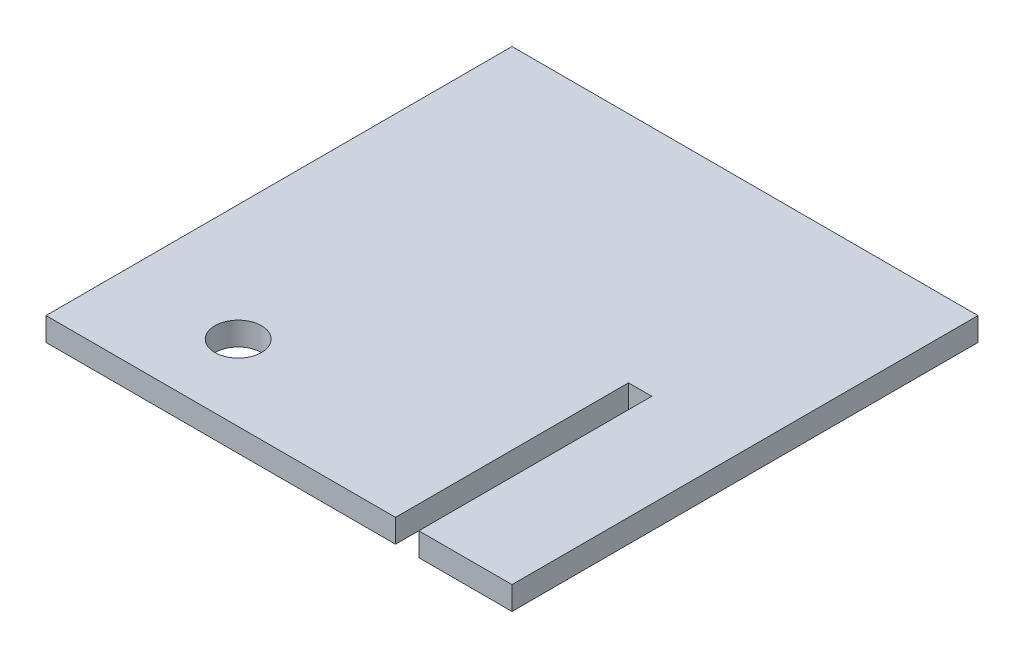
ISO-10303-21;
HEADER;
FILE_DESCRIPTION(('STEP AP214'),'2;1');
FILE_NAME('part.step','',(''),(''),'','','');
FILE_SCHEMA(('AUTOMOTIVE_DESIGN { 1 0 10303 214 1 1 1 1 }'));
ENDSEC;
DATA;
#1=APPLICATION_CONTEXT('core data for automotive mechanical design processes');
#2=APPLICATION_PROTOCOL_DEFINITION('international standard','automotive_design',2000,#1);
#3=PRODUCT_CONTEXT('',#1,'mechanical');
#4=PRODUCT('Part','Part','',(#3));
#5=PRODUCT_RELATED_PRODUCT_CATEGORY('part','',(#4));
#6=PRODUCT_DEFINITION_FORMATION('','',#4);
#7=PRODUCT_DEFINITION_CONTEXT('part definition',#1,'design');
#8=PRODUCT_DEFINITION('design','',#6,#7);
#9=PRODUCT_DEFINITION_SHAPE('','',#8);
#10=(LENGTH_UNIT() NAMED_UNIT(*) SI_UNIT(.MILLI.,.METRE.));
#11=(NAMED_UNIT(*) PLANE_ANGLE_UNIT() SI_UNIT($,.RADIAN.));
#12=(NAMED_UNIT(*) SI_UNIT($,.STERADIAN.) SOLID_ANGLE_UNIT());
#13=UNCERTAINTY_MEASURE_WITH_UNIT(LENGTH_MEASURE(1.E-05),#10,'distance_accuracy_value','');
#14=(GEOMETRIC_REPRESENTATION_CONTEXT(3) GLOBAL_UNCERTAINTY_ASSIGNED_CONTEXT((#13)) GLOBAL_UNIT_ASSIGNED_CONTEXT((#10,
#11,#12)) REPRESENTATION_CONTEXT('',''));
#15=CARTESIAN_POINT('',(0.,0.,0.));
#16=DIRECTION('',(0.,0.,1.));
#17=DIRECTION('',(1.,0.,0.));
#18=AXIS2_PLACEMENT_3D('',#15,#16,#17);
#19=CARTESIAN_POINT('',(-127.,6.35,0.));
#20=DIRECTION('',(0.,0.,-1.));
#21=DIRECTION('',(-1.,0.,0.));
#22=AXIS2_PLACEMENT_3D('',#19,#20,#21);
#23=PLANE('',#22);
#24=DIRECTION('',(1.,0.,0.));
#25=VECTOR('',#24,1.);
#26=CARTESIAN_POINT('',(-127.,6.35,0.));
#27=LINE('',#26,#25);
#28=CARTESIAN_POINT('',(76.2000000000002,6.35000000000002,0.));
#29=VERTEX_POINT('',#28);
#30=CARTESIAN_POINT('',(127.,6.35,0.));
#31=VERTEX_POINT('',#30);
#32=EDGE_CURVE('E139',#29,#31,#27,.T.);
#33=ORIENTED_EDGE('',*,*,#32,.F.);
#34=DIRECTION('',(0.,1.,0.));
#35=VECTOR('',#34,1.);
#36=CARTESIAN_POINT('',(76.2000000000002,-6.35000000000002,0.));
#37=LINE('',#36,#35);
#38=CARTESIAN_POINT('',(76.2000000000002,-6.35000000000002,0.));
#39=VERTEX_POINT('',#38);
#40=EDGE_CURVE('E128',#39,#29,#37,.T.);
#41=ORIENTED_EDGE('',*,*,#40,.F.);
#42=DIRECTION('',(1.,0.,0.));
#43=VECTOR('',#42,1.);
#44=CARTESIAN_POINT('',(-127.,-6.35,0.));
#45=LINE('',#44,#43);
#46=CARTESIAN_POINT('',(127.,-6.35,0.));
#47=VERTEX_POINT('',#46);
#48=EDGE_CURVE('E89',#39,#47,#45,.T.);
#49=ORIENTED_EDGE('',*,*,#48,.T.);
#50=DIRECTION('',(0.,-1.,0.));
#51=VECTOR('',#50,1.);
#52=CARTESIAN_POINT('',(127.,6.35,0.));
#53=LINE('',#52,#51);
#54=EDGE_CURVE('E117',#31,#47,#53,.T.);
#55=ORIENTED_EDGE('',*,*,#54,.F.);
#56=EDGE_LOOP('',(#33,#41,#49,#55));
#57=FACE_BOUND('',#56,.T.);
#58=ADVANCED_FACE('F37',(#57),#23,.F.);
#59=CARTESIAN_POINT('',(-127.,6.35,0.));
#60=DIRECTION('',(1.,0.,0.));
#61=DIRECTION('',(0.,0.,-1.));
#62=AXIS2_PLACEMENT_3D('',#59,#60,#61);
#63=PLANE('',#62);
#64=DIRECTION('',(0.,0.,1.));
#65=VECTOR('',#64,1.);
#66=CARTESIAN_POINT('',(-127.,-6.35,0.));
#67=LINE('',#66,#65);
#68=CARTESIAN_POINT('',(-127.,-6.35,-254.));
#69=VERTEX_POINT('',#68);
#70=CARTESIAN_POINT('',(-127.,-6.35,0.));
#71=VERTEX_POINT('',#70);
#72=EDGE_CURVE('E123',#69,#71,#67,.T.);
#73=ORIENTED_EDGE('',*,*,#72,.T.);
#74=DIRECTION('',(0.,-1.,0.));
#75=VECTOR('',#74,1.);
#76=CARTESIAN_POINT('',(-127.,6.35,0.));
#77=LINE('',#76,#75);
#78=CARTESIAN_POINT('',(-127.,6.35,0.));
#79=VERTEX_POINT('',#78);
#80=EDGE_CURVE('E145',#79,#71,#77,.T.);
#81=ORIENTED_EDGE('',*,*,#80,.F.);
#82=DIRECTION('',(0.,0.,1.));
#83=VECTOR('',#82,1.);
#84=CARTESIAN_POINT('',(-127.,6.35,0.));
#85=LINE('',#84,#83);
#86=CARTESIAN_POINT('',(-127.,6.35,-254.));
#87=VERTEX_POINT('',#86);
#88=EDGE_CURVE('E124',#87,#79,#85,.T.);
#89=ORIENTED_EDGE('',*,*,#88,.F.);
#90=DIRECTION('',(0.,-1.,0.));
#91=VECTOR('',#90,1.);
#92=CARTESIAN_POINT('',(-127.,6.35,-254.));
#93=LINE('',#92,#91);
#94=EDGE_CURVE('E112',#87,#69,#93,.T.);
#95=ORIENTED_EDGE('',*,*,#94,.T.);
#96=EDGE_LOOP('',(#73,#81,#89,#95));
#97=FACE_BOUND('',#96,.T.);
#98=ADVANCED_FACE('F121',(#97),#63,.F.);
#99=CARTESIAN_POINT('',(63.5000000000002,-6.35000000000002,0.));
#100=VERTEX_POINT('',#99);
#101=EDGE_CURVE('E60',#71,#100,#45,.T.);
#102=ORIENTED_EDGE('',*,*,#101,.T.);
#103=DIRECTION('',(0.,1.,0.));
#104=VECTOR('',#103,1.);
#105=CARTESIAN_POINT('',(63.5000000000002,-6.35000000000002,0.));
#106=LINE('',#105,#104);
#107=CARTESIAN_POINT('',(63.5000000000002,6.35000000000002,0.));
#108=VERTEX_POINT('',#107);
#109=EDGE_CURVE('E130',#100,#108,#106,.T.);
#110=ORIENTED_EDGE('',*,*,#109,.T.);
#111=EDGE_CURVE('E80',#79,#108,#27,.T.);
#112=ORIENTED_EDGE('',*,*,#111,.F.);
#113=ORIENTED_EDGE('',*,*,#80,.T.);
#114=EDGE_LOOP('',(#102,#110,#112,#113));
#115=FACE_BOUND('',#114,.T.);
#116=ADVANCED_FACE('F186',(#115),#23,.F.);
#117=CARTESIAN_POINT('',(127.,6.35,0.));
#118=DIRECTION('',(-1.,0.,0.));
#119=DIRECTION('',(0.,0.,1.));
#120=AXIS2_PLACEMENT_3D('',#117,#118,#119);
#121=PLANE('',#120);
#122=DIRECTION('',(0.,0.,-1.));
#123=VECTOR('',#122,1.);
#124=CARTESIAN_POINT('',(127.,-6.35,0.));
#125=LINE('',#124,#123);
#126=CARTESIAN_POINT('',(127.,-6.35,-254.));
#127=VERTEX_POINT('',#126);
#128=EDGE_CURVE('E144',#47,#127,#125,.T.);
#129=ORIENTED_EDGE('',*,*,#128,.T.);
#130=DIRECTION('',(0.,-1.,0.));
#131=VECTOR('',#130,1.);
#132=CARTESIAN_POINT('',(127.,6.35,-254.));
#133=LINE('',#132,#131);
#134=CARTESIAN_POINT('',(127.,6.35,-254.));
#135=VERTEX_POINT('',#134);
#136=EDGE_CURVE('E115',#135,#127,#133,.T.);
#137=ORIENTED_EDGE('',*,*,#136,.F.);
#138=DIRECTION('',(0.,0.,-1.));
#139=VECTOR('',#138,1.);
#140=CARTESIAN_POINT('',(127.,6.35,0.));
#141=LINE('',#140,#139);
#142=EDGE_CURVE('E137',#31,#135,#141,.T.);
#143=ORIENTED_EDGE('',*,*,#142,.F.);
#144=ORIENTED_EDGE('',*,*,#54,.T.);
#145=EDGE_LOOP('',(#129,#137,#143,#144));
#146=FACE_BOUND('',#145,.T.);
#147=ADVANCED_FACE('F188',(#146),#121,.F.);
#148=CARTESIAN_POINT('',(-127.,6.35,-254.));
#149=DIRECTION('',(0.,0.,1.));
#150=DIRECTION('',(1.,0.,0.));
#151=AXIS2_PLACEMENT_3D('',#148,#149,#150);
#152=PLANE('',#151);
#153=DIRECTION('',(-1.,0.,0.));
#154=VECTOR('',#153,1.);
#155=CARTESIAN_POINT('',(-127.,-6.35,-254.));
#156=LINE('',#155,#154);
#157=EDGE_CURVE('E108',#127,#69,#156,.T.);
#158=ORIENTED_EDGE('',*,*,#157,.T.);
#159=ORIENTED_EDGE('',*,*,#94,.F.);
#160=DIRECTION('',(-1.,0.,0.));
#161=VECTOR('',#160,1.);
#162=CARTESIAN_POINT('',(-127.,6.35,-254.));
#163=LINE('',#162,#161);
#164=EDGE_CURVE('E135',#135,#87,#163,.T.);
#165=ORIENTED_EDGE('',*,*,#164,.F.);
#166=ORIENTED_EDGE('',*,*,#136,.T.);
#167=EDGE_LOOP('',(#158,#159,#165,#166));
#168=FACE_BOUND('',#167,.T.);
#169=ADVANCED_FACE('F110',(#168),#152,.F.);
#170=CARTESIAN_POINT('',(0.,6.35,0.));
#171=DIRECTION('',(0.,-1.,0.));
#172=DIRECTION('',(0.,0.,-1.));
#173=AXIS2_PLACEMENT_3D('',#170,#171,#172);
#174=PLANE('',#173);
#175=CARTESIAN_POINT('',(-63.4999999999998,6.35000000000002,-41.2500000000038));
#176=DIRECTION('',(0.,-1.,0.));
#177=DIRECTION('',(0.,0.,-1.));
#178=AXIS2_PLACEMENT_3D('',#175,#176,#177);
#179=CIRCLE('',#178,12.7);
#180=CARTESIAN_POINT('',(-63.4999999999998,6.35000000000002,-53.9500000000038));
#181=VERTEX_POINT('',#180);
#182=EDGE_CURVE('E11',#181,#181,#179,.F.);
#183=ORIENTED_EDGE('',*,*,#182,.F.);
#184=EDGE_LOOP('',(#183));
#185=FACE_BOUND('',#184,.T.);
#186=DIRECTION('',(-1.,0.,0.));
#187=VECTOR('',#186,1.);
#188=CARTESIAN_POINT('',(76.2000000000002,6.35000000000002,-127.));
#189=LINE('',#188,#187);
#190=CARTESIAN_POINT('',(76.2000000000002,6.35000000000002,-127.));
#191=VERTEX_POINT('',#190);
#192=CARTESIAN_POINT('',(63.5000000000002,6.35000000000002,-127.));
#193=VERTEX_POINT('',#192);
#194=EDGE_CURVE('E164',#191,#193,#189,.T.);
#195=ORIENTED_EDGE('',*,*,#194,.F.);
#196=DIRECTION('',(0.,0.,-1.));
#197=VECTOR('',#196,1.);
#198=CARTESIAN_POINT('',(76.2000000000002,6.35000000000002,0.));
#199=LINE('',#198,#197);
#200=EDGE_CURVE('E167',#29,#191,#199,.T.);
#201=ORIENTED_EDGE('',*,*,#200,.F.);
#202=ORIENTED_EDGE('',*,*,#32,.T.);
#203=ORIENTED_EDGE('',*,*,#142,.T.);
#204=ORIENTED_EDGE('',*,*,#164,.T.);
#205=ORIENTED_EDGE('',*,*,#88,.T.);
#206=ORIENTED_EDGE('',*,*,#111,.T.);
#207=DIRECTION('',(0.,0.,1.));
#208=VECTOR('',#207,1.);
#209=CARTESIAN_POINT('',(63.5000000000002,6.35000000000002,0.));
#210=LINE('',#209,#208);
#211=EDGE_CURVE('E161',#193,#108,#210,.T.);
#212=ORIENTED_EDGE('',*,*,#211,.F.);
#213=EDGE_LOOP('',(#195,#201,#202,#203,#204,#205,#206,#212));
#214=FACE_BOUND('',#213,.T.);
#215=ADVANCED_FACE('F39',(#185,#214),#174,.F.);
#216=CARTESIAN_POINT('',(0.,-6.35,0.));
#217=DIRECTION('',(0.,-1.,0.));
#218=DIRECTION('',(0.,0.,-1.));
#219=AXIS2_PLACEMENT_3D('',#216,#217,#218);
#220=PLANE('',#219);
#221=DIRECTION('',(0.,0.,-1.));
#222=VECTOR('',#221,1.);
#223=CARTESIAN_POINT('',(76.2000000000002,-6.35000000000002,0.));
#224=LINE('',#223,#222);
#225=CARTESIAN_POINT('',(76.2000000000002,-6.35000000000002,-127.));
#226=VERTEX_POINT('',#225);
#227=EDGE_CURVE('E98',#39,#226,#224,.T.);
#228=ORIENTED_EDGE('',*,*,#227,.T.);
#229=DIRECTION('',(-1.,0.,0.));
#230=VECTOR('',#229,1.);
#231=CARTESIAN_POINT('',(76.2000000000002,-6.35000000000002,-127.));
#232=LINE('',#231,#230);
#233=CARTESIAN_POINT('',(63.5000000000002,-6.35,-127.));
#234=VERTEX_POINT('',#233);
#235=EDGE_CURVE('E157',#226,#234,#232,.T.);
#236=ORIENTED_EDGE('',*,*,#235,.T.);
#237=DIRECTION('',(0.,0.,1.));
#238=VECTOR('',#237,1.);
#239=CARTESIAN_POINT('',(63.5000000000002,-6.35000000000002,0.));
#240=LINE('',#239,#238);
#241=EDGE_CURVE('E52',#234,#100,#240,.T.);
#242=ORIENTED_EDGE('',*,*,#241,.T.);
#243=ORIENTED_EDGE('',*,*,#101,.F.);
#244=ORIENTED_EDGE('',*,*,#72,.F.);
#245=ORIENTED_EDGE('',*,*,#157,.F.);
#246=ORIENTED_EDGE('',*,*,#128,.F.);
#247=ORIENTED_EDGE('',*,*,#48,.F.);
#248=EDGE_LOOP('',(#228,#236,#242,#243,#244,#245,#246,#247));
#249=FACE_BOUND('',#248,.T.);
#250=CARTESIAN_POINT('',(-63.4999999999998,-6.35000000000002,-41.2500000000038));
#251=DIRECTION('',(0.,-1.,0.));
#252=DIRECTION('',(0.,0.,-1.));
#253=AXIS2_PLACEMENT_3D('',#250,#251,#252);
#254=CIRCLE('',#253,12.7);
#255=CARTESIAN_POINT('',(-63.4999999999998,-6.35000000000002,-53.9500000000038));
#256=VERTEX_POINT('',#255);
#257=EDGE_CURVE('E45',#256,#256,#254,.F.);
#258=ORIENTED_EDGE('',*,*,#257,.T.);
#259=EDGE_LOOP('',(#258));
#260=FACE_BOUND('',#259,.T.);
#261=ADVANCED_FACE('F126',(#249,#260),#220,.T.);
#262=CARTESIAN_POINT('',(-63.4999999999998,280.149999999998,-41.2500000000038));
#263=DIRECTION('',(0.,-1.,0.));
#264=DIRECTION('',(0.,0.,-1.));
#265=AXIS2_PLACEMENT_3D('',#262,#263,#264);
#266=CYLINDRICAL_SURFACE('',#265,12.7);
#267=ORIENTED_EDGE('',*,*,#257,.F.);
#268=EDGE_LOOP('',(#267));
#269=FACE_BOUND('',#268,.T.);
#270=ORIENTED_EDGE('',*,*,#182,.T.);
#271=EDGE_LOOP('',(#270));
#272=FACE_BOUND('',#271,.T.);
#273=ADVANCED_FACE('F229',(#269,#272),#266,.F.);
#274=CARTESIAN_POINT('',(76.2000000000002,-6.35000000000002,0.));
#275=DIRECTION('',(1.,0.,0.));
#276=DIRECTION('',(0.,0.,-1.));
#277=AXIS2_PLACEMENT_3D('',#274,#275,#276);
#278=PLANE('',#277);
#279=DIRECTION('',(0.,1.,0.));
#280=VECTOR('',#279,1.);
#281=CARTESIAN_POINT('',(76.2000000000002,-6.35000000000002,-127.));
#282=LINE('',#281,#280);
#283=EDGE_CURVE('E150',#226,#191,#282,.T.);
#284=ORIENTED_EDGE('',*,*,#283,.F.);
#285=ORIENTED_EDGE('',*,*,#227,.F.);
#286=ORIENTED_EDGE('',*,*,#40,.T.);
#287=ORIENTED_EDGE('',*,*,#200,.T.);
#288=EDGE_LOOP('',(#284,#285,#286,#287));
#289=FACE_BOUND('',#288,.T.);
#290=ADVANCED_FACE('F172',(#289),#278,.F.);
#291=CARTESIAN_POINT('',(63.5000000000002,-6.35000000000002,0.));
#292=DIRECTION('',(-1.,0.,0.));
#293=DIRECTION('',(0.,0.,1.));
#294=AXIS2_PLACEMENT_3D('',#291,#292,#293);
#295=PLANE('',#294);
#296=ORIENTED_EDGE('',*,*,#109,.F.);
#297=ORIENTED_EDGE('',*,*,#241,.F.);
#298=DIRECTION('',(0.,1.,0.));
#299=VECTOR('',#298,1.);
#300=CARTESIAN_POINT('',(63.5000000000002,-6.35000000000002,-127.));
#301=LINE('',#300,#299);
#302=EDGE_CURVE('E153',#234,#193,#301,.T.);
#303=ORIENTED_EDGE('',*,*,#302,.T.);
#304=ORIENTED_EDGE('',*,*,#211,.T.);
#305=EDGE_LOOP('',(#296,#297,#303,#304));
#306=FACE_BOUND('',#305,.T.);
#307=ADVANCED_FACE('F185',(#306),#295,.F.);
#308=CARTESIAN_POINT('',(76.2000000000002,-6.35000000000002,-127.));
#309=DIRECTION('',(0.,0.,-1.));
#310=DIRECTION('',(-1.,0.,0.));
#311=AXIS2_PLACEMENT_3D('',#308,#309,#310);
#312=PLANE('',#311);
#313=ORIENTED_EDGE('',*,*,#302,.F.);
#314=ORIENTED_EDGE('',*,*,#235,.F.);
#315=ORIENTED_EDGE('',*,*,#283,.T.);
#316=ORIENTED_EDGE('',*,*,#194,.T.);
#317=EDGE_LOOP('',(#313,#314,#315,#316));
#318=FACE_BOUND('',#317,.T.);
#319=ADVANCED_FACE('F180',(#318),#312,.F.);
#320=CLOSED_SHELL('',(#58,#98,#116,#147,#169,#215,#261,#273,#290,#307,#319));
#321=MANIFOLD_SOLID_BREP('B2',#320);
#322=ADVANCED_BREP_SHAPE_REPRESENTATION('',(#18,#321),#14);
#323=SHAPE_DEFINITION_REPRESENTATION(#9,#322);
ENDSEC;
END-ISO-10303-21;
